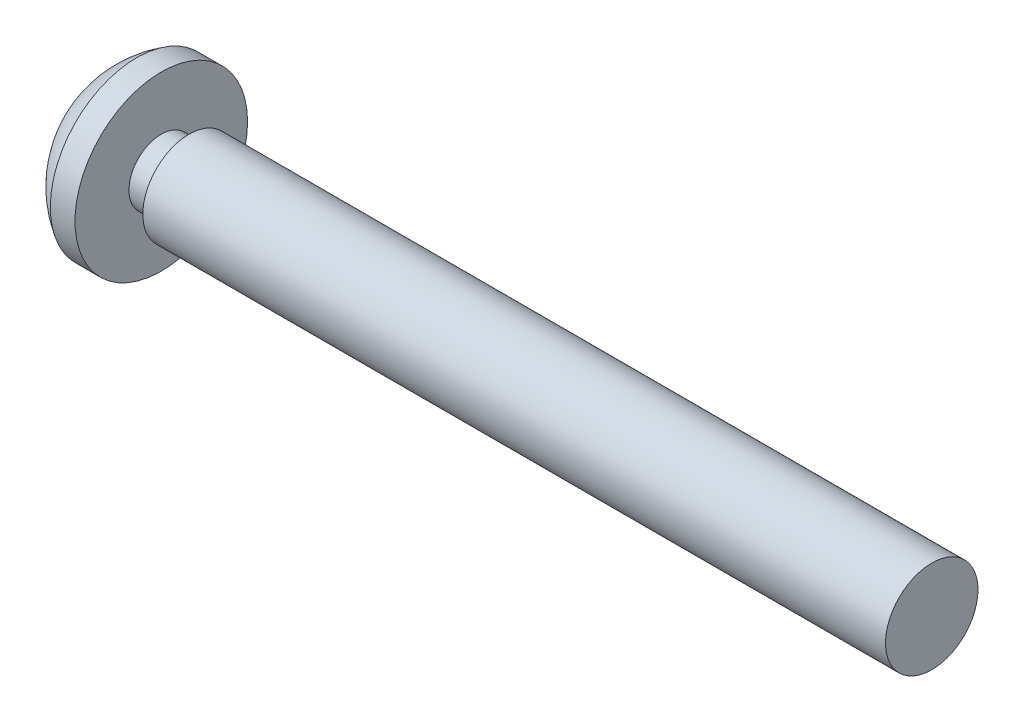
ISO-10303-21;
HEADER;
FILE_DESCRIPTION(('STEP AP214'),'2;1');
FILE_NAME('part.step','',(''),(''),'','','');
FILE_SCHEMA(('AUTOMOTIVE_DESIGN { 1 0 10303 214 1 1 1 1 }'));
ENDSEC;
DATA;
#1=APPLICATION_CONTEXT('core data for automotive mechanical design processes');
#2=APPLICATION_PROTOCOL_DEFINITION('international standard','automotive_design',2000,#1);
#3=PRODUCT_CONTEXT('',#1,'mechanical');
#4=PRODUCT('Part','Part','',(#3));
#5=PRODUCT_RELATED_PRODUCT_CATEGORY('part','',(#4));
#6=PRODUCT_DEFINITION_FORMATION('','',#4);
#7=PRODUCT_DEFINITION_CONTEXT('part definition',#1,'design');
#8=PRODUCT_DEFINITION('design','',#6,#7);
#9=PRODUCT_DEFINITION_SHAPE('','',#8);
#10=(LENGTH_UNIT() NAMED_UNIT(*) SI_UNIT(.MILLI.,.METRE.));
#11=(NAMED_UNIT(*) PLANE_ANGLE_UNIT() SI_UNIT($,.RADIAN.));
#12=(NAMED_UNIT(*) SI_UNIT($,.STERADIAN.) SOLID_ANGLE_UNIT());
#13=UNCERTAINTY_MEASURE_WITH_UNIT(LENGTH_MEASURE(1.E-05),#10,'distance_accuracy_value','');
#14=(GEOMETRIC_REPRESENTATION_CONTEXT(3) GLOBAL_UNCERTAINTY_ASSIGNED_CONTEXT((#13)) GLOBAL_UNIT_ASSIGNED_CONTEXT((#10,
#11,#12)) REPRESENTATION_CONTEXT('',''));
#15=CARTESIAN_POINT('',(0.,0.,0.));
#16=DIRECTION('',(0.,0.,1.));
#17=DIRECTION('',(1.,0.,0.));
#18=AXIS2_PLACEMENT_3D('',#15,#16,#17);
#19=CARTESIAN_POINT('',(-24.15,0.,0.));
#20=DIRECTION('',(1.,0.,0.));
#21=DIRECTION('',(0.,1.,0.));
#22=AXIS2_PLACEMENT_3D('',#19,#20,#21);
#23=SPHERICAL_SURFACE('',#22,3.25);
#24=CARTESIAN_POINT('',(-25.8,0.,0.));
#25=DIRECTION('',(1.,0.,0.));
#26=DIRECTION('',(0.,0.,-1.));
#27=AXIS2_PLACEMENT_3D('',#24,#25,#26);
#28=CIRCLE('',#27,2.8);
#29=CARTESIAN_POINT('',(-25.8,0.,-2.8));
#30=VERTEX_POINT('',#29);
#31=EDGE_CURVE('E170',#30,#30,#28,.T.);
#32=ORIENTED_EDGE('',*,*,#31,.F.);
#33=EDGE_LOOP('',(#32));
#34=FACE_BOUND('',#33,.T.);
#35=CARTESIAN_POINT('',(-27.3068940289468,0.375000066666674,-0.675199999999999));
#36=CARTESIAN_POINT('',(-27.31039538603,0.374974039787709,-0.658850385121531));
#37=CARTESIAN_POINT('',(-27.3136133722107,0.37631432389268,-0.642432860727959));
#38=CARTESIAN_POINT('',(-27.3193993644706,0.381684853078188,-0.609919694568041));
#39=CARTESIAN_POINT('',(-27.3219670797919,0.385716298547903,-0.593824199743856));
#40=CARTESIAN_POINT('',(-27.3263691557337,0.396434080962598,-0.562405806208291));
#41=CARTESIAN_POINT('',(-27.3282024640236,0.40312420038652,-0.547084043435579));
#42=CARTESIAN_POINT('',(-27.3310682853566,0.418991926287625,-0.517716698727841));
#43=CARTESIAN_POINT('',(-27.3321013161393,0.428167919333055,-0.503670296900031));
#44=CARTESIAN_POINT('',(-27.333317814792,0.448514526561983,-0.477587734148935));
#45=CARTESIAN_POINT('',(-27.3335204359993,0.45963392816965,-0.465512496825722));
#46=CARTESIAN_POINT('',(-27.3331219469987,0.483685195957618,-0.443340514979258));
#47=CARTESIAN_POINT('',(-27.3325207910735,0.496617165195829,-0.43324388303273));
#48=CARTESIAN_POINT('',(-27.3305465495203,0.52375198188587,-0.415414384530054));
#49=CARTESIAN_POINT('',(-27.3291823028179,0.53793873877994,-0.407655989689833));
#50=CARTESIAN_POINT('',(-27.3257316366459,0.567301133586124,-0.39453703708237));
#51=CARTESIAN_POINT('',(-27.3236451638736,0.582476844419147,-0.389176656363358));
#52=CARTESIAN_POINT('',(-27.3192512828636,0.610594589490666,-0.381701859125301));
#53=CARTESIAN_POINT('',(-27.317051373952,0.623446563005218,-0.379176670553307));
#54=CARTESIAN_POINT('',(-27.3122574783827,0.649278469056087,-0.375820322941036));
#55=CARTESIAN_POINT('',(-27.3096640610531,0.662258191795707,-0.37498674113212));
#56=CARTESIAN_POINT('',(-27.3068940289468,0.675199999999999,-0.375000066666674));
#57=B_SPLINE_CURVE_WITH_KNOTS('',3,(#35,#36,#37,#38,#39,#40,#41,#42,#43,#44,#45,#46,#47,#48,#49,
#50,#51,#52,#53,#54,#55,#56),.UNSPECIFIED.,.F.,.F.,(4,2,2,2,2,2,2,2,2,2,4),(0.,
0.0501133292441577,0.100249026425948,0.150456308180251,0.20063108114174,0.249641830902457,
0.298655368418994,0.347112597227158,0.395573403099857,0.435304823461775,0.474979299046477),.UNSPECIFIED.);
#58=CARTESIAN_POINT('',(-27.3069368064629,0.375,-0.675));
#59=VERTEX_POINT('',#58);
#60=CARTESIAN_POINT('',(-27.3069368064629,0.675,-0.375));
#61=VERTEX_POINT('',#60);
#62=EDGE_CURVE('E202',#59,#61,#57,.T.);
#63=ORIENTED_EDGE('',*,*,#62,.T.);
#64=CARTESIAN_POINT('',(-24.15,0.,-0.375));
#65=DIRECTION('',(0.,0.,1.));
#66=DIRECTION('',(1.,0.,0.));
#67=AXIS2_PLACEMENT_3D('',#64,#65,#66);
#68=CIRCLE('',#67,3.22829289253624);
#69=CARTESIAN_POINT('',(-26.8299020504489,1.8,-0.375));
#70=VERTEX_POINT('',#69);
#71=EDGE_CURVE('E11',#61,#70,#68,.F.);
#72=ORIENTED_EDGE('',*,*,#71,.T.);
#73=CARTESIAN_POINT('',(-24.15,1.8,0.));
#74=DIRECTION('',(0.,-1.,0.));
#75=DIRECTION('',(0.,0.,-1.));
#76=AXIS2_PLACEMENT_3D('',#73,#74,#75);
#77=CIRCLE('',#76,2.70601182554696);
#78=CARTESIAN_POINT('',(-26.8299020504489,1.8,0.375));
#79=VERTEX_POINT('',#78);
#80=EDGE_CURVE('E47',#70,#79,#77,.F.);
#81=ORIENTED_EDGE('',*,*,#80,.T.);
#82=CARTESIAN_POINT('',(-24.15,0.,0.375));
#83=DIRECTION('',(0.,0.,-1.));
#84=DIRECTION('',(0.,1.,0.));
#85=AXIS2_PLACEMENT_3D('',#82,#83,#84);
#86=CIRCLE('',#85,3.22829289253624);
#87=CARTESIAN_POINT('',(-27.3069368064629,0.675,0.375));
#88=VERTEX_POINT('',#87);
#89=EDGE_CURVE('E311',#79,#88,#86,.F.);
#90=ORIENTED_EDGE('',*,*,#89,.T.);
#91=CARTESIAN_POINT('',(-27.3068940289468,0.675199999999999,0.375000066666674));
#92=CARTESIAN_POINT('',(-27.31039538603,0.658850385121531,0.374974039787708));
#93=CARTESIAN_POINT('',(-27.3136133722107,0.642432860727959,0.37631432389268));
#94=CARTESIAN_POINT('',(-27.3193993644706,0.609919694568041,0.381684853078188));
#95=CARTESIAN_POINT('',(-27.3219670797919,0.593824199743856,0.385716298547903));
#96=CARTESIAN_POINT('',(-27.3263691557337,0.562405806208291,0.396434080962598));
#97=CARTESIAN_POINT('',(-27.3282024640236,0.547084043435579,0.403124200386519));
#98=CARTESIAN_POINT('',(-27.3310682853566,0.517716698727841,0.418991926287625));
#99=CARTESIAN_POINT('',(-27.3321013161393,0.503670296900031,0.428167919333055));
#100=CARTESIAN_POINT('',(-27.333317814792,0.477587734148935,0.448514526561983));
#101=CARTESIAN_POINT('',(-27.3335204359993,0.465512496825722,0.45963392816965));
#102=CARTESIAN_POINT('',(-27.3331219469987,0.443340514979258,0.483685195957618));
#103=CARTESIAN_POINT('',(-27.3325207910735,0.43324388303273,0.496617165195828));
#104=CARTESIAN_POINT('',(-27.3305465495203,0.415414384530054,0.52375198188587));
#105=CARTESIAN_POINT('',(-27.3291823028179,0.407655989689833,0.537938738779939));
#106=CARTESIAN_POINT('',(-27.3257316366459,0.39453703708237,0.567301133586124));
#107=CARTESIAN_POINT('',(-27.3236451638736,0.389176656363358,0.582476844419147));
#108=CARTESIAN_POINT('',(-27.3192512828636,0.381701859125301,0.610594589490666));
#109=CARTESIAN_POINT('',(-27.317051373952,0.379176670553307,0.623446563005217));
#110=CARTESIAN_POINT('',(-27.3122574783827,0.375820322941036,0.649278469056086));
#111=CARTESIAN_POINT('',(-27.3096640610531,0.37498674113212,0.662258191795707));
#112=CARTESIAN_POINT('',(-27.3068940289468,0.375000066666674,0.675199999999999));
#113=B_SPLINE_CURVE_WITH_KNOTS('',3,(#91,#92,#93,#94,#95,#96,#97,#98,#99,#100,#101,#102,#103,
#104,#105,#106,#107,#108,#109,#110,#111,#112),.UNSPECIFIED.,.F.,.F.,(4,2,2,2,2,2,2,2,2,2,4),(0.,
0.0501133292441578,0.100249026425948,0.150456308180252,0.20063108114174,0.249641830902456,
0.298655368418993,0.347112597227157,0.395573403099857,0.435304823461775,0.474979299046478),.UNSPECIFIED.);
#114=CARTESIAN_POINT('',(-27.3069368064629,0.375,0.675));
#115=VERTEX_POINT('',#114);
#116=EDGE_CURVE('E302',#88,#115,#113,.T.);
#117=ORIENTED_EDGE('',*,*,#116,.T.);
#118=CARTESIAN_POINT('',(-24.15,0.375,0.));
#119=DIRECTION('',(0.,-1.,0.));
#120=DIRECTION('',(0.,0.,-1.));
#121=AXIS2_PLACEMENT_3D('',#118,#119,#120);
#122=CIRCLE('',#121,3.22829289253624);
#123=CARTESIAN_POINT('',(-26.8299020504489,0.375,1.8));
#124=VERTEX_POINT('',#123);
#125=EDGE_CURVE('E312',#115,#124,#122,.F.);
#126=ORIENTED_EDGE('',*,*,#125,.T.);
#127=CARTESIAN_POINT('',(-24.15,0.,1.8));
#128=DIRECTION('',(0.,0.,-1.));
#129=DIRECTION('',(-1.,0.,0.));
#130=AXIS2_PLACEMENT_3D('',#127,#128,#129);
#131=CIRCLE('',#130,2.70601182554696);
#132=CARTESIAN_POINT('',(-26.8299020504489,-0.375,1.8));
#133=VERTEX_POINT('',#132);
#134=EDGE_CURVE('E431',#124,#133,#131,.F.);
#135=ORIENTED_EDGE('',*,*,#134,.T.);
#136=CARTESIAN_POINT('',(-24.15,-0.375,0.));
#137=DIRECTION('',(0.,1.,0.));
#138=DIRECTION('',(0.,0.,1.));
#139=AXIS2_PLACEMENT_3D('',#136,#137,#138);
#140=CIRCLE('',#139,3.22829289253624);
#141=CARTESIAN_POINT('',(-27.3069368064629,-0.375,0.675));
#142=VERTEX_POINT('',#141);
#143=EDGE_CURVE('E273',#133,#142,#140,.F.);
#144=ORIENTED_EDGE('',*,*,#143,.T.);
#145=CARTESIAN_POINT('',(-27.3068940289468,-0.375000066666674,0.675199999999999));
#146=CARTESIAN_POINT('',(-27.31039538603,-0.374974039787708,0.658850385121531));
#147=CARTESIAN_POINT('',(-27.3136133722107,-0.37631432389268,0.642432860727959));
#148=CARTESIAN_POINT('',(-27.3193993644706,-0.381684853078188,0.609919694568042));
#149=CARTESIAN_POINT('',(-27.3219670797919,-0.385716298547903,0.593824199743856));
#150=CARTESIAN_POINT('',(-27.3263691557337,-0.396434080962598,0.562405806208292));
#151=CARTESIAN_POINT('',(-27.3282024640236,-0.403124200386519,0.547084043435579));
#152=CARTESIAN_POINT('',(-27.3310682853566,-0.418991926287625,0.517716698727842));
#153=CARTESIAN_POINT('',(-27.3321013161393,-0.428167919333055,0.503670296900031));
#154=CARTESIAN_POINT('',(-27.333317814792,-0.448514526561982,0.477587734148936));
#155=CARTESIAN_POINT('',(-27.3335204359993,-0.45963392816965,0.465512496825722));
#156=CARTESIAN_POINT('',(-27.3331219469987,-0.483685195957617,0.443340514979258));
#157=CARTESIAN_POINT('',(-27.3325207910735,-0.496617165195828,0.433243883032731));
#158=CARTESIAN_POINT('',(-27.3305465495203,-0.523751981885869,0.415414384530054));
#159=CARTESIAN_POINT('',(-27.3291823028179,-0.537938738779939,0.407655989689833));
#160=CARTESIAN_POINT('',(-27.3257316366459,-0.567301133586124,0.39453703708237));
#161=CARTESIAN_POINT('',(-27.3236451638736,-0.582476844419147,0.389176656363358));
#162=CARTESIAN_POINT('',(-27.3192512828636,-0.610594589490666,0.381701859125301));
#163=CARTESIAN_POINT('',(-27.317051373952,-0.623446563005218,0.379176670553306));
#164=CARTESIAN_POINT('',(-27.3122574783827,-0.649278469056087,0.375820322941036));
#165=CARTESIAN_POINT('',(-27.3096640610531,-0.662258191795707,0.37498674113212));
#166=CARTESIAN_POINT('',(-27.3068940289468,-0.675199999999999,0.375000066666674));
#167=B_SPLINE_CURVE_WITH_KNOTS('',3,(#145,#146,#147,#148,#149,#150,#151,#152,#153,#154,#155,
#156,#157,#158,#159,#160,#161,#162,#163,#164,#165,#166),.UNSPECIFIED.,.F.,.F.,(4,2,2,2,2,2,2,2,
2,2,4),(0.,0.0501133292441573,0.100249026425948,0.150456308180251,0.200631081141739,
0.249641830902456,0.298655368418994,0.347112597227157,0.395573403099857,0.435304823461776,
0.474979299046479),.UNSPECIFIED.);
#168=CARTESIAN_POINT('',(-27.3069368064629,-0.675,0.375));
#169=VERTEX_POINT('',#168);
#170=EDGE_CURVE('E264',#142,#169,#167,.T.);
#171=ORIENTED_EDGE('',*,*,#170,.T.);
#172=CARTESIAN_POINT('',(-24.15,0.,0.375));
#173=DIRECTION('',(0.,0.,-1.));
#174=DIRECTION('',(-1.,0.,0.));
#175=AXIS2_PLACEMENT_3D('',#172,#173,#174);
#176=CIRCLE('',#175,3.22829289253624);
#177=CARTESIAN_POINT('',(-26.8299020504489,-1.8,0.375));
#178=VERTEX_POINT('',#177);
#179=EDGE_CURVE('E260',#169,#178,#176,.F.);
#180=ORIENTED_EDGE('',*,*,#179,.T.);
#181=CARTESIAN_POINT('',(-24.15,-1.8,0.));
#182=DIRECTION('',(0.,1.,0.));
#183=DIRECTION('',(0.,0.,1.));
#184=AXIS2_PLACEMENT_3D('',#181,#182,#183);
#185=CIRCLE('',#184,2.70601182554696);
#186=CARTESIAN_POINT('',(-26.8299020504489,-1.8,-0.375));
#187=VERTEX_POINT('',#186);
#188=EDGE_CURVE('E256',#178,#187,#185,.F.);
#189=ORIENTED_EDGE('',*,*,#188,.T.);
#190=CARTESIAN_POINT('',(-24.15,0.,-0.375));
#191=DIRECTION('',(0.,0.,1.));
#192=DIRECTION('',(0.,-1.,0.));
#193=AXIS2_PLACEMENT_3D('',#190,#191,#192);
#194=CIRCLE('',#193,3.22829289253624);
#195=CARTESIAN_POINT('',(-27.3069368064629,-0.675,-0.375));
#196=VERTEX_POINT('',#195);
#197=EDGE_CURVE('E251',#187,#196,#194,.F.);
#198=ORIENTED_EDGE('',*,*,#197,.T.);
#199=CARTESIAN_POINT('',(-27.3068940289468,-0.675199999999999,-0.375000066666674));
#200=CARTESIAN_POINT('',(-27.31039538603,-0.658850385121531,-0.374974039787709));
#201=CARTESIAN_POINT('',(-27.3136133722107,-0.642432860727959,-0.37631432389268));
#202=CARTESIAN_POINT('',(-27.3193993644706,-0.609919694568042,-0.381684853078188));
#203=CARTESIAN_POINT('',(-27.3219670797919,-0.593824199743856,-0.385716298547903));
#204=CARTESIAN_POINT('',(-27.3263691557337,-0.562405806208292,-0.396434080962598));
#205=CARTESIAN_POINT('',(-27.3282024640236,-0.547084043435579,-0.403124200386519));
#206=CARTESIAN_POINT('',(-27.3310682853566,-0.517716698727842,-0.418991926287625));
#207=CARTESIAN_POINT('',(-27.3321013161393,-0.503670296900031,-0.428167919333055));
#208=CARTESIAN_POINT('',(-27.333317814792,-0.477587734148936,-0.448514526561982));
#209=CARTESIAN_POINT('',(-27.3335204359993,-0.465512496825722,-0.45963392816965));
#210=CARTESIAN_POINT('',(-27.3331219469987,-0.443340514979258,-0.483685195957618));
#211=CARTESIAN_POINT('',(-27.3325207910735,-0.433243883032731,-0.496617165195828));
#212=CARTESIAN_POINT('',(-27.3305465495203,-0.415414384530054,-0.52375198188587));
#213=CARTESIAN_POINT('',(-27.3291823028179,-0.407655989689833,-0.537938738779939));
#214=CARTESIAN_POINT('',(-27.3257316366459,-0.39453703708237,-0.567301133586124));
#215=CARTESIAN_POINT('',(-27.3236451638736,-0.389176656363358,-0.582476844419147));
#216=CARTESIAN_POINT('',(-27.3192512828636,-0.381701859125301,-0.610594589490667));
#217=CARTESIAN_POINT('',(-27.317051373952,-0.379176670553306,-0.623446563005218));
#218=CARTESIAN_POINT('',(-27.3122574783827,-0.375820322941036,-0.649278469056087));
#219=CARTESIAN_POINT('',(-27.3096640610531,-0.37498674113212,-0.662258191795707));
#220=CARTESIAN_POINT('',(-27.3068940289468,-0.375000066666674,-0.675199999999999));
#221=B_SPLINE_CURVE_WITH_KNOTS('',3,(#199,#200,#201,#202,#203,#204,#205,#206,#207,#208,#209,
#210,#211,#212,#213,#214,#215,#216,#217,#218,#219,#220),.UNSPECIFIED.,.F.,.F.,(4,2,2,2,2,2,2,2,
2,2,4),(0.,0.0501133292441573,0.100249026425948,0.150456308180251,0.200631081141739,
0.249641830902456,0.298655368418994,0.347112597227158,0.395573403099857,0.435304823461776,
0.474979299046478),.UNSPECIFIED.);
#222=CARTESIAN_POINT('',(-27.3069368064629,-0.375,-0.675));
#223=VERTEX_POINT('',#222);
#224=EDGE_CURVE('E242',#196,#223,#221,.T.);
#225=ORIENTED_EDGE('',*,*,#224,.T.);
#226=CARTESIAN_POINT('',(-24.15,-0.375,0.));
#227=DIRECTION('',(0.,1.,0.));
#228=DIRECTION('',(0.,0.,1.));
#229=AXIS2_PLACEMENT_3D('',#226,#227,#228);
#230=CIRCLE('',#229,3.22829289253624);
#231=CARTESIAN_POINT('',(-26.8299020504489,-0.375,-1.8));
#232=VERTEX_POINT('',#231);
#233=EDGE_CURVE('E252',#223,#232,#230,.F.);
#234=ORIENTED_EDGE('',*,*,#233,.T.);
#235=CARTESIAN_POINT('',(-24.15,0.,-1.8));
#236=DIRECTION('',(0.,0.,1.));
#237=DIRECTION('',(1.,0.,0.));
#238=AXIS2_PLACEMENT_3D('',#235,#236,#237);
#239=CIRCLE('',#238,2.70601182554696);
#240=CARTESIAN_POINT('',(-26.8299020504489,0.375,-1.8));
#241=VERTEX_POINT('',#240);
#242=EDGE_CURVE('E424',#232,#241,#239,.F.);
#243=ORIENTED_EDGE('',*,*,#242,.T.);
#244=CARTESIAN_POINT('',(-24.15,0.375,0.));
#245=DIRECTION('',(0.,-1.,0.));
#246=DIRECTION('',(0.,0.,-1.));
#247=AXIS2_PLACEMENT_3D('',#244,#245,#246);
#248=CIRCLE('',#247,3.22829289253624);
#249=EDGE_CURVE('E212',#241,#59,#248,.F.);
#250=ORIENTED_EDGE('',*,*,#249,.T.);
#251=EDGE_LOOP('',(#63,#72,#81,#90,#117,#126,#135,#144,#171,#180,#189,#198,#225,#234,#243,#250));
#252=FACE_BOUND('',#251,.T.);
#253=ADVANCED_FACE('F38',(#34,#252),#23,.T.);
#254=CARTESIAN_POINT('',(0.,0.,0.));
#255=DIRECTION('',(1.,0.,0.));
#256=DIRECTION('',(0.,0.,-1.));
#257=AXIS2_PLACEMENT_3D('',#254,#255,#256);
#258=PLANE('',#257);
#259=CARTESIAN_POINT('',(0.,0.,0.));
#260=DIRECTION('',(1.,0.,0.));
#261=DIRECTION('',(0.,0.,-1.));
#262=AXIS2_PLACEMENT_3D('',#259,#260,#261);
#263=CIRCLE('',#262,1.5);
#264=CARTESIAN_POINT('',(0.,0.,-1.5));
#265=VERTEX_POINT('',#264);
#266=EDGE_CURVE('E198',#265,#265,#263,.T.);
#267=ORIENTED_EDGE('',*,*,#266,.T.);
#268=EDGE_LOOP('',(#267));
#269=FACE_BOUND('',#268,.T.);
#270=ADVANCED_FACE('F40',(#269),#258,.T.);
#271=CARTESIAN_POINT('',(0.,0.,0.));
#272=DIRECTION('',(1.,0.,0.));
#273=DIRECTION('',(0.,0.,-1.));
#274=AXIS2_PLACEMENT_3D('',#271,#272,#273);
#275=CYLINDRICAL_SURFACE('',#274,1.5);
#276=CARTESIAN_POINT('',(-24.1,0.,0.));
#277=DIRECTION('',(1.,0.,0.));
#278=DIRECTION('',(0.,0.,-1.));
#279=AXIS2_PLACEMENT_3D('',#276,#277,#278);
#280=CIRCLE('',#279,1.5);
#281=CARTESIAN_POINT('',(-24.1,0.,-1.5));
#282=VERTEX_POINT('',#281);
#283=EDGE_CURVE('E194',#282,#282,#280,.T.);
#284=ORIENTED_EDGE('',*,*,#283,.T.);
#285=EDGE_LOOP('',(#284));
#286=FACE_BOUND('',#285,.T.);
#287=ORIENTED_EDGE('',*,*,#266,.F.);
#288=EDGE_LOOP('',(#287));
#289=FACE_BOUND('',#288,.T.);
#290=ADVANCED_FACE('F461',(#286,#289),#275,.T.);
#291=CARTESIAN_POINT('',(-24.1,1.5,0.));
#292=DIRECTION('',(-1.,0.,0.));
#293=DIRECTION('',(0.,0.,1.));
#294=AXIS2_PLACEMENT_3D('',#291,#292,#293);
#295=PLANE('',#294);
#296=CARTESIAN_POINT('',(-24.1,0.,0.));
#297=DIRECTION('',(1.,0.,0.));
#298=DIRECTION('',(0.,0.,-1.));
#299=AXIS2_PLACEMENT_3D('',#296,#297,#298);
#300=CIRCLE('',#299,1.05);
#301=CARTESIAN_POINT('',(-24.1,0.,-1.05));
#302=VERTEX_POINT('',#301);
#303=EDGE_CURVE('E191',#302,#302,#300,.T.);
#304=ORIENTED_EDGE('',*,*,#303,.T.);
#305=EDGE_LOOP('',(#304));
#306=FACE_BOUND('',#305,.T.);
#307=ORIENTED_EDGE('',*,*,#283,.F.);
#308=EDGE_LOOP('',(#307));
#309=FACE_BOUND('',#308,.T.);
#310=ADVANCED_FACE('F479',(#306,#309),#295,.T.);
#311=CARTESIAN_POINT('',(0.,0.,0.));
#312=DIRECTION('',(1.,0.,0.));
#313=DIRECTION('',(0.,0.,-1.));
#314=AXIS2_PLACEMENT_3D('',#311,#312,#313);
#315=CYLINDRICAL_SURFACE('',#314,1.05);
#316=CARTESIAN_POINT('',(-25.,0.,0.));
#317=DIRECTION('',(1.,0.,0.));
#318=DIRECTION('',(0.,0.,-1.));
#319=AXIS2_PLACEMENT_3D('',#316,#317,#318);
#320=CIRCLE('',#319,1.05);
#321=CARTESIAN_POINT('',(-25.,0.,-1.05));
#322=VERTEX_POINT('',#321);
#323=EDGE_CURVE('E187',#322,#322,#320,.T.);
#324=ORIENTED_EDGE('',*,*,#323,.T.);
#325=EDGE_LOOP('',(#324));
#326=FACE_BOUND('',#325,.T.);
#327=ORIENTED_EDGE('',*,*,#303,.F.);
#328=EDGE_LOOP('',(#327));
#329=FACE_BOUND('',#328,.T.);
#330=ADVANCED_FACE('F473',(#326,#329),#315,.T.);
#331=CARTESIAN_POINT('',(-25.,1.05,0.));
#332=DIRECTION('',(1.,0.,0.));
#333=DIRECTION('',(0.,0.,-1.));
#334=AXIS2_PLACEMENT_3D('',#331,#332,#333);
#335=PLANE('',#334);
#336=CARTESIAN_POINT('',(-25.,0.,0.));
#337=DIRECTION('',(1.,0.,0.));
#338=DIRECTION('',(0.,0.,-1.));
#339=AXIS2_PLACEMENT_3D('',#336,#337,#338);
#340=CIRCLE('',#339,2.8);
#341=CARTESIAN_POINT('',(-25.,0.,-2.8));
#342=VERTEX_POINT('',#341);
#343=EDGE_CURVE('E177',#342,#342,#340,.T.);
#344=ORIENTED_EDGE('',*,*,#343,.T.);
#345=EDGE_LOOP('',(#344));
#346=FACE_BOUND('',#345,.T.);
#347=ORIENTED_EDGE('',*,*,#323,.F.);
#348=EDGE_LOOP('',(#347));
#349=FACE_BOUND('',#348,.T.);
#350=ADVANCED_FACE('F468',(#346,#349),#335,.T.);
#351=CARTESIAN_POINT('',(0.,0.,0.));
#352=DIRECTION('',(1.,0.,0.));
#353=DIRECTION('',(0.,0.,-1.));
#354=AXIS2_PLACEMENT_3D('',#351,#352,#353);
#355=CYLINDRICAL_SURFACE('',#354,2.8);
#356=ORIENTED_EDGE('',*,*,#31,.T.);
#357=EDGE_LOOP('',(#356));
#358=FACE_BOUND('',#357,.T.);
#359=ORIENTED_EDGE('',*,*,#343,.F.);
#360=EDGE_LOOP('',(#359));
#361=FACE_BOUND('',#360,.T.);
#362=ADVANCED_FACE('F465',(#358,#361),#355,.T.);
#363=CARTESIAN_POINT('',(-26.2,1.8,-0.375));
#364=DIRECTION('',(0.,0.,1.));
#365=DIRECTION('',(1.,0.,0.));
#366=AXIS2_PLACEMENT_3D('',#363,#364,#365);
#367=PLANE('',#366);
#368=DIRECTION('',(-1.,0.,0.));
#369=VECTOR('',#368,1.);
#370=CARTESIAN_POINT('',(-26.2,0.675,-0.375));
#371=LINE('',#370,#369);
#372=CARTESIAN_POINT('',(-26.2,0.675,-0.375));
#373=VERTEX_POINT('',#372);
#374=EDGE_CURVE('E54',#373,#61,#371,.T.);
#375=ORIENTED_EDGE('',*,*,#374,.F.);
#376=DIRECTION('',(0.,1.,0.));
#377=VECTOR('',#376,1.);
#378=CARTESIAN_POINT('',(-26.2,1.8,-0.375));
#379=LINE('',#378,#377);
#380=CARTESIAN_POINT('',(-26.2,1.8,-0.375));
#381=VERTEX_POINT('',#380);
#382=EDGE_CURVE('E157',#373,#381,#379,.T.);
#383=ORIENTED_EDGE('',*,*,#382,.T.);
#384=DIRECTION('',(-1.,0.,0.));
#385=VECTOR('',#384,1.);
#386=CARTESIAN_POINT('',(-26.2,1.8,-0.375));
#387=LINE('',#386,#385);
#388=EDGE_CURVE('E165',#381,#70,#387,.T.);
#389=ORIENTED_EDGE('',*,*,#388,.T.);
#390=ORIENTED_EDGE('',*,*,#71,.F.);
#391=EDGE_LOOP('',(#375,#383,#389,#390));
#392=FACE_BOUND('',#391,.T.);
#393=ADVANCED_FACE('F164',(#392),#367,.T.);
#394=CARTESIAN_POINT('',(-26.2,1.8,-0.375));
#395=DIRECTION('',(0.,-1.,0.));
#396=DIRECTION('',(0.,0.,-1.));
#397=AXIS2_PLACEMENT_3D('',#394,#395,#396);
#398=PLANE('',#397);
#399=ORIENTED_EDGE('',*,*,#388,.F.);
#400=DIRECTION('',(0.,0.,1.));
#401=VECTOR('',#400,1.);
#402=CARTESIAN_POINT('',(-26.2,1.8,-0.375));
#403=LINE('',#402,#401);
#404=CARTESIAN_POINT('',(-26.2,1.8,0.375));
#405=VERTEX_POINT('',#404);
#406=EDGE_CURVE('E153',#381,#405,#403,.T.);
#407=ORIENTED_EDGE('',*,*,#406,.T.);
#408=DIRECTION('',(-1.,0.,0.));
#409=VECTOR('',#408,1.);
#410=CARTESIAN_POINT('',(-26.2,1.8,0.375));
#411=LINE('',#410,#409);
#412=EDGE_CURVE('E171',#405,#79,#411,.T.);
#413=ORIENTED_EDGE('',*,*,#412,.T.);
#414=ORIENTED_EDGE('',*,*,#80,.F.);
#415=EDGE_LOOP('',(#399,#407,#413,#414));
#416=FACE_BOUND('',#415,.T.);
#417=ADVANCED_FACE('F168',(#416),#398,.T.);
#418=CARTESIAN_POINT('',(-26.2,1.8,0.375));
#419=DIRECTION('',(0.,0.,-1.));
#420=DIRECTION('',(0.,1.,0.));
#421=AXIS2_PLACEMENT_3D('',#418,#419,#420);
#422=PLANE('',#421);
#423=ORIENTED_EDGE('',*,*,#412,.F.);
#424=DIRECTION('',(0.,-1.,0.));
#425=VECTOR('',#424,1.);
#426=CARTESIAN_POINT('',(-26.2,1.8,0.375));
#427=LINE('',#426,#425);
#428=CARTESIAN_POINT('',(-26.2,0.675,0.375));
#429=VERTEX_POINT('',#428);
#430=EDGE_CURVE('E159',#405,#429,#427,.T.);
#431=ORIENTED_EDGE('',*,*,#430,.T.);
#432=DIRECTION('',(-1.,0.,0.));
#433=VECTOR('',#432,1.);
#434=CARTESIAN_POINT('',(-26.2,0.675,0.375));
#435=LINE('',#434,#433);
#436=EDGE_CURVE('E180',#429,#88,#435,.T.);
#437=ORIENTED_EDGE('',*,*,#436,.T.);
#438=ORIENTED_EDGE('',*,*,#89,.F.);
#439=EDGE_LOOP('',(#423,#431,#437,#438));
#440=FACE_BOUND('',#439,.T.);
#441=ADVANCED_FACE('F298',(#440),#422,.T.);
#442=CARTESIAN_POINT('',(-26.2,0.675,0.675));
#443=DIRECTION('',(-1.,0.,0.));
#444=DIRECTION('',(0.,0.,1.));
#445=AXIS2_PLACEMENT_3D('',#442,#443,#444);
#446=CYLINDRICAL_SURFACE('',#445,0.3);
#447=ORIENTED_EDGE('',*,*,#436,.F.);
#448=CARTESIAN_POINT('',(-26.2,0.675,0.675));
#449=DIRECTION('',(-1.,0.,0.));
#450=DIRECTION('',(0.,0.,1.));
#451=AXIS2_PLACEMENT_3D('',#448,#449,#450);
#452=CIRCLE('',#451,0.3);
#453=CARTESIAN_POINT('',(-26.2,0.375,0.675));
#454=VERTEX_POINT('',#453);
#455=EDGE_CURVE('E378',#429,#454,#452,.T.);
#456=ORIENTED_EDGE('',*,*,#455,.T.);
#457=DIRECTION('',(-1.,0.,0.));
#458=VECTOR('',#457,1.);
#459=CARTESIAN_POINT('',(-26.2,0.375,0.675));
#460=LINE('',#459,#458);
#461=EDGE_CURVE('E371',#454,#115,#460,.T.);
#462=ORIENTED_EDGE('',*,*,#461,.T.);
#463=ORIENTED_EDGE('',*,*,#116,.F.);
#464=EDGE_LOOP('',(#447,#456,#462,#463));
#465=FACE_BOUND('',#464,.T.);
#466=ADVANCED_FACE('F293',(#465),#446,.T.);
#467=CARTESIAN_POINT('',(-26.2,0.375,0.675));
#468=DIRECTION('',(0.,-1.,0.));
#469=DIRECTION('',(0.,0.,-1.));
#470=AXIS2_PLACEMENT_3D('',#467,#468,#469);
#471=PLANE('',#470);
#472=ORIENTED_EDGE('',*,*,#461,.F.);
#473=DIRECTION('',(0.,0.,1.));
#474=VECTOR('',#473,1.);
#475=CARTESIAN_POINT('',(-26.2,0.375,0.675));
#476=LINE('',#475,#474);
#477=CARTESIAN_POINT('',(-26.2,0.375,1.8));
#478=VERTEX_POINT('',#477);
#479=EDGE_CURVE('E382',#454,#478,#476,.T.);
#480=ORIENTED_EDGE('',*,*,#479,.T.);
#481=DIRECTION('',(-1.,0.,0.));
#482=VECTOR('',#481,1.);
#483=CARTESIAN_POINT('',(-26.2,0.375,1.8));
#484=LINE('',#483,#482);
#485=EDGE_CURVE('E368',#478,#124,#484,.T.);
#486=ORIENTED_EDGE('',*,*,#485,.T.);
#487=ORIENTED_EDGE('',*,*,#125,.F.);
#488=EDGE_LOOP('',(#472,#480,#486,#487));
#489=FACE_BOUND('',#488,.T.);
#490=ADVANCED_FACE('F289',(#489),#471,.T.);
#491=CARTESIAN_POINT('',(-26.2,0.375,1.8));
#492=DIRECTION('',(0.,0.,-1.));
#493=DIRECTION('',(-1.,0.,0.));
#494=AXIS2_PLACEMENT_3D('',#491,#492,#493);
#495=PLANE('',#494);
#496=ORIENTED_EDGE('',*,*,#485,.F.);
#497=DIRECTION('',(0.,-1.,0.));
#498=VECTOR('',#497,1.);
#499=CARTESIAN_POINT('',(-26.2,0.375,1.8));
#500=LINE('',#499,#498);
#501=CARTESIAN_POINT('',(-26.2,-0.375,1.8));
#502=VERTEX_POINT('',#501);
#503=EDGE_CURVE('E387',#478,#502,#500,.T.);
#504=ORIENTED_EDGE('',*,*,#503,.T.);
#505=DIRECTION('',(-1.,0.,0.));
#506=VECTOR('',#505,1.);
#507=CARTESIAN_POINT('',(-26.2,-0.375,1.8));
#508=LINE('',#507,#506);
#509=EDGE_CURVE('E364',#502,#133,#508,.T.);
#510=ORIENTED_EDGE('',*,*,#509,.T.);
#511=ORIENTED_EDGE('',*,*,#134,.F.);
#512=EDGE_LOOP('',(#496,#504,#510,#511));
#513=FACE_BOUND('',#512,.T.);
#514=ADVANCED_FACE('F285',(#513),#495,.T.);
#515=CARTESIAN_POINT('',(-26.2,-0.375,0.675));
#516=DIRECTION('',(0.,1.,0.));
#517=DIRECTION('',(0.,0.,1.));
#518=AXIS2_PLACEMENT_3D('',#515,#516,#517);
#519=PLANE('',#518);
#520=ORIENTED_EDGE('',*,*,#509,.F.);
#521=DIRECTION('',(0.,0.,-1.));
#522=VECTOR('',#521,1.);
#523=CARTESIAN_POINT('',(-26.2,-0.375,0.675));
#524=LINE('',#523,#522);
#525=CARTESIAN_POINT('',(-26.2,-0.375,0.675));
#526=VERTEX_POINT('',#525);
#527=EDGE_CURVE('E394',#502,#526,#524,.T.);
#528=ORIENTED_EDGE('',*,*,#527,.T.);
#529=DIRECTION('',(-1.,0.,0.));
#530=VECTOR('',#529,1.);
#531=CARTESIAN_POINT('',(-26.2,-0.375,0.675));
#532=LINE('',#531,#530);
#533=EDGE_CURVE('E360',#526,#142,#532,.T.);
#534=ORIENTED_EDGE('',*,*,#533,.T.);
#535=ORIENTED_EDGE('',*,*,#143,.F.);
#536=EDGE_LOOP('',(#520,#528,#534,#535));
#537=FACE_BOUND('',#536,.T.);
#538=ADVANCED_FACE('F281',(#537),#519,.T.);
#539=CARTESIAN_POINT('',(-26.2,-0.675,0.675));
#540=DIRECTION('',(-1.,0.,0.));
#541=DIRECTION('',(0.,0.,1.));
#542=AXIS2_PLACEMENT_3D('',#539,#540,#541);
#543=CYLINDRICAL_SURFACE('',#542,0.3);
#544=ORIENTED_EDGE('',*,*,#533,.F.);
#545=CARTESIAN_POINT('',(-26.2,-0.675,0.675));
#546=DIRECTION('',(-1.,0.,0.));
#547=DIRECTION('',(0.,0.,-1.));
#548=AXIS2_PLACEMENT_3D('',#545,#546,#547);
#549=CIRCLE('',#548,0.3);
#550=CARTESIAN_POINT('',(-26.2,-0.675,0.375));
#551=VERTEX_POINT('',#550);
#552=EDGE_CURVE('E397',#526,#551,#549,.T.);
#553=ORIENTED_EDGE('',*,*,#552,.T.);
#554=DIRECTION('',(-1.,0.,0.));
#555=VECTOR('',#554,1.);
#556=CARTESIAN_POINT('',(-26.2,-0.675,0.375));
#557=LINE('',#556,#555);
#558=EDGE_CURVE('E356',#551,#169,#557,.T.);
#559=ORIENTED_EDGE('',*,*,#558,.T.);
#560=ORIENTED_EDGE('',*,*,#170,.F.);
#561=EDGE_LOOP('',(#544,#553,#559,#560));
#562=FACE_BOUND('',#561,.T.);
#563=ADVANCED_FACE('F275',(#562),#543,.T.);
#564=CARTESIAN_POINT('',(-26.2,-0.675,0.375));
#565=DIRECTION('',(0.,0.,-1.));
#566=DIRECTION('',(-1.,0.,0.));
#567=AXIS2_PLACEMENT_3D('',#564,#565,#566);
#568=PLANE('',#567);
#569=ORIENTED_EDGE('',*,*,#558,.F.);
#570=DIRECTION('',(0.,-1.,0.));
#571=VECTOR('',#570,1.);
#572=CARTESIAN_POINT('',(-26.2,-0.675,0.375));
#573=LINE('',#572,#571);
#574=CARTESIAN_POINT('',(-26.2,-1.8,0.375));
#575=VERTEX_POINT('',#574);
#576=EDGE_CURVE('E400',#551,#575,#573,.T.);
#577=ORIENTED_EDGE('',*,*,#576,.T.);
#578=DIRECTION('',(-1.,0.,0.));
#579=VECTOR('',#578,1.);
#580=CARTESIAN_POINT('',(-26.2,-1.8,0.375));
#581=LINE('',#580,#579);
#582=EDGE_CURVE('E352',#575,#178,#581,.T.);
#583=ORIENTED_EDGE('',*,*,#582,.T.);
#584=ORIENTED_EDGE('',*,*,#179,.F.);
#585=EDGE_LOOP('',(#569,#577,#583,#584));
#586=FACE_BOUND('',#585,.T.);
#587=ADVANCED_FACE('F280',(#586),#568,.T.);
#588=CARTESIAN_POINT('',(-26.2,-1.8,-0.375));
#589=DIRECTION('',(0.,1.,0.));
#590=DIRECTION('',(0.,0.,1.));
#591=AXIS2_PLACEMENT_3D('',#588,#589,#590);
#592=PLANE('',#591);
#593=ORIENTED_EDGE('',*,*,#582,.F.);
#594=DIRECTION('',(0.,0.,-1.));
#595=VECTOR('',#594,1.);
#596=CARTESIAN_POINT('',(-26.2,-1.8,-0.375));
#597=LINE('',#596,#595);
#598=CARTESIAN_POINT('',(-26.2,-1.8,-0.375));
#599=VERTEX_POINT('',#598);
#600=EDGE_CURVE('E403',#575,#599,#597,.T.);
#601=ORIENTED_EDGE('',*,*,#600,.T.);
#602=DIRECTION('',(-1.,0.,0.));
#603=VECTOR('',#602,1.);
#604=CARTESIAN_POINT('',(-26.2,-1.8,-0.375));
#605=LINE('',#604,#603);
#606=EDGE_CURVE('E348',#599,#187,#605,.T.);
#607=ORIENTED_EDGE('',*,*,#606,.T.);
#608=ORIENTED_EDGE('',*,*,#188,.F.);
#609=EDGE_LOOP('',(#593,#601,#607,#608));
#610=FACE_BOUND('',#609,.T.);
#611=ADVANCED_FACE('F449',(#610),#592,.T.);
#612=CARTESIAN_POINT('',(-26.2,-0.675,-0.375));
#613=DIRECTION('',(0.,0.,1.));
#614=DIRECTION('',(0.,-1.,0.));
#615=AXIS2_PLACEMENT_3D('',#612,#613,#614);
#616=PLANE('',#615);
#617=ORIENTED_EDGE('',*,*,#606,.F.);
#618=DIRECTION('',(0.,1.,0.));
#619=VECTOR('',#618,1.);
#620=CARTESIAN_POINT('',(-26.2,-0.675,-0.375));
#621=LINE('',#620,#619);
#622=CARTESIAN_POINT('',(-26.2,-0.675,-0.375));
#623=VERTEX_POINT('',#622);
#624=EDGE_CURVE('E406',#599,#623,#621,.T.);
#625=ORIENTED_EDGE('',*,*,#624,.T.);
#626=DIRECTION('',(-1.,0.,0.));
#627=VECTOR('',#626,1.);
#628=CARTESIAN_POINT('',(-26.2,-0.675,-0.375));
#629=LINE('',#628,#627);
#630=EDGE_CURVE('E345',#623,#196,#629,.T.);
#631=ORIENTED_EDGE('',*,*,#630,.T.);
#632=ORIENTED_EDGE('',*,*,#197,.F.);
#633=EDGE_LOOP('',(#617,#625,#631,#632));
#634=FACE_BOUND('',#633,.T.);
#635=ADVANCED_FACE('F238',(#634),#616,.T.);
#636=CARTESIAN_POINT('',(-26.2,-0.675,-0.675));
#637=DIRECTION('',(-1.,0.,0.));
#638=DIRECTION('',(0.,0.,1.));
#639=AXIS2_PLACEMENT_3D('',#636,#637,#638);
#640=CYLINDRICAL_SURFACE('',#639,0.3);
#641=ORIENTED_EDGE('',*,*,#630,.F.);
#642=CARTESIAN_POINT('',(-26.2,-0.675,-0.675));
#643=DIRECTION('',(-1.,0.,0.));
#644=DIRECTION('',(0.,0.,1.));
#645=AXIS2_PLACEMENT_3D('',#642,#643,#644);
#646=CIRCLE('',#645,0.3);
#647=CARTESIAN_POINT('',(-26.2,-0.375,-0.675));
#648=VERTEX_POINT('',#647);
#649=EDGE_CURVE('E409',#623,#648,#646,.T.);
#650=ORIENTED_EDGE('',*,*,#649,.T.);
#651=DIRECTION('',(-1.,0.,0.));
#652=VECTOR('',#651,1.);
#653=CARTESIAN_POINT('',(-26.2,-0.375,-0.675));
#654=LINE('',#653,#652);
#655=EDGE_CURVE('E341',#648,#223,#654,.T.);
#656=ORIENTED_EDGE('',*,*,#655,.T.);
#657=ORIENTED_EDGE('',*,*,#224,.F.);
#658=EDGE_LOOP('',(#641,#650,#656,#657));
#659=FACE_BOUND('',#658,.T.);
#660=ADVANCED_FACE('F233',(#659),#640,.T.);
#661=CARTESIAN_POINT('',(-26.2,-0.375,-1.8));
#662=DIRECTION('',(0.,1.,0.));
#663=DIRECTION('',(0.,0.,1.));
#664=AXIS2_PLACEMENT_3D('',#661,#662,#663);
#665=PLANE('',#664);
#666=ORIENTED_EDGE('',*,*,#655,.F.);
#667=DIRECTION('',(0.,0.,-1.));
#668=VECTOR('',#667,1.);
#669=CARTESIAN_POINT('',(-26.2,-0.375,-1.8));
#670=LINE('',#669,#668);
#671=CARTESIAN_POINT('',(-26.2,-0.375,-1.8));
#672=VERTEX_POINT('',#671);
#673=EDGE_CURVE('E412',#648,#672,#670,.T.);
#674=ORIENTED_EDGE('',*,*,#673,.T.);
#675=DIRECTION('',(-1.,0.,0.));
#676=VECTOR('',#675,1.);
#677=CARTESIAN_POINT('',(-26.2,-0.375,-1.8));
#678=LINE('',#677,#676);
#679=EDGE_CURVE('E331',#672,#232,#678,.T.);
#680=ORIENTED_EDGE('',*,*,#679,.T.);
#681=ORIENTED_EDGE('',*,*,#233,.F.);
#682=EDGE_LOOP('',(#666,#674,#680,#681));
#683=FACE_BOUND('',#682,.T.);
#684=ADVANCED_FACE('F229',(#683),#665,.T.);
#685=CARTESIAN_POINT('',(-26.2,0.375,-1.8));
#686=DIRECTION('',(0.,0.,1.));
#687=DIRECTION('',(1.,0.,0.));
#688=AXIS2_PLACEMENT_3D('',#685,#686,#687);
#689=PLANE('',#688);
#690=ORIENTED_EDGE('',*,*,#679,.F.);
#691=DIRECTION('',(0.,1.,0.));
#692=VECTOR('',#691,1.);
#693=CARTESIAN_POINT('',(-26.2,0.375,-1.8));
#694=LINE('',#693,#692);
#695=CARTESIAN_POINT('',(-26.2,0.375,-1.8));
#696=VERTEX_POINT('',#695);
#697=EDGE_CURVE('E415',#672,#696,#694,.T.);
#698=ORIENTED_EDGE('',*,*,#697,.T.);
#699=DIRECTION('',(-1.,0.,0.));
#700=VECTOR('',#699,1.);
#701=CARTESIAN_POINT('',(-26.2,0.375,-1.8));
#702=LINE('',#701,#700);
#703=EDGE_CURVE('E328',#696,#241,#702,.T.);
#704=ORIENTED_EDGE('',*,*,#703,.T.);
#705=ORIENTED_EDGE('',*,*,#242,.F.);
#706=EDGE_LOOP('',(#690,#698,#704,#705));
#707=FACE_BOUND('',#706,.T.);
#708=ADVANCED_FACE('F225',(#707),#689,.T.);
#709=CARTESIAN_POINT('',(-26.2,0.375,-1.8));
#710=DIRECTION('',(0.,-1.,0.));
#711=DIRECTION('',(0.,0.,-1.));
#712=AXIS2_PLACEMENT_3D('',#709,#710,#711);
#713=PLANE('',#712);
#714=ORIENTED_EDGE('',*,*,#703,.F.);
#715=DIRECTION('',(0.,0.,1.));
#716=VECTOR('',#715,1.);
#717=CARTESIAN_POINT('',(-26.2,0.375,-1.8));
#718=LINE('',#717,#716);
#719=CARTESIAN_POINT('',(-26.2,0.375,-0.675));
#720=VERTEX_POINT('',#719);
#721=EDGE_CURVE('E326',#696,#720,#718,.T.);
#722=ORIENTED_EDGE('',*,*,#721,.T.);
#723=DIRECTION('',(-1.,0.,0.));
#724=VECTOR('',#723,1.);
#725=CARTESIAN_POINT('',(-26.2,0.375,-0.675));
#726=LINE('',#725,#724);
#727=EDGE_CURVE('E322',#720,#59,#726,.T.);
#728=ORIENTED_EDGE('',*,*,#727,.T.);
#729=ORIENTED_EDGE('',*,*,#249,.F.);
#730=EDGE_LOOP('',(#714,#722,#728,#729));
#731=FACE_BOUND('',#730,.T.);
#732=ADVANCED_FACE('F222',(#731),#713,.T.);
#733=CARTESIAN_POINT('',(-26.2,0.675,-0.675));
#734=DIRECTION('',(-1.,0.,0.));
#735=DIRECTION('',(0.,0.,1.));
#736=AXIS2_PLACEMENT_3D('',#733,#734,#735);
#737=CYLINDRICAL_SURFACE('',#736,0.3);
#738=ORIENTED_EDGE('',*,*,#727,.F.);
#739=CARTESIAN_POINT('',(-26.2,0.675,-0.675));
#740=DIRECTION('',(-1.,0.,0.));
#741=DIRECTION('',(0.,0.,1.));
#742=AXIS2_PLACEMENT_3D('',#739,#740,#741);
#743=CIRCLE('',#742,0.3);
#744=EDGE_CURVE('E334',#720,#373,#743,.T.);
#745=ORIENTED_EDGE('',*,*,#744,.T.);
#746=ORIENTED_EDGE('',*,*,#374,.T.);
#747=ORIENTED_EDGE('',*,*,#62,.F.);
#748=EDGE_LOOP('',(#738,#745,#746,#747));
#749=FACE_BOUND('',#748,.T.);
#750=ADVANCED_FACE('F217',(#749),#737,.T.);
#751=CARTESIAN_POINT('',(-26.2,0.675,-0.675));
#752=DIRECTION('',(-1.,0.,0.));
#753=DIRECTION('',(0.,0.,1.));
#754=AXIS2_PLACEMENT_3D('',#751,#752,#753);
#755=PLANE('',#754);
#756=ORIENTED_EDGE('',*,*,#382,.F.);
#757=ORIENTED_EDGE('',*,*,#744,.F.);
#758=ORIENTED_EDGE('',*,*,#721,.F.);
#759=ORIENTED_EDGE('',*,*,#697,.F.);
#760=ORIENTED_EDGE('',*,*,#673,.F.);
#761=ORIENTED_EDGE('',*,*,#649,.F.);
#762=ORIENTED_EDGE('',*,*,#624,.F.);
#763=ORIENTED_EDGE('',*,*,#600,.F.);
#764=ORIENTED_EDGE('',*,*,#576,.F.);
#765=ORIENTED_EDGE('',*,*,#552,.F.);
#766=ORIENTED_EDGE('',*,*,#527,.F.);
#767=ORIENTED_EDGE('',*,*,#503,.F.);
#768=ORIENTED_EDGE('',*,*,#479,.F.);
#769=ORIENTED_EDGE('',*,*,#455,.F.);
#770=ORIENTED_EDGE('',*,*,#430,.F.);
#771=ORIENTED_EDGE('',*,*,#406,.F.);
#772=EDGE_LOOP('',(#756,#757,#758,#759,#760,#761,#762,#763,#764,#765,#766,#767,#768,#769,#770,#771));
#773=FACE_BOUND('',#772,.T.);
#774=ADVANCED_FACE('F155',(#773),#755,.T.);
#775=CLOSED_SHELL('',(#253,#270,#290,#310,#330,#350,#362,#393,#417,#441,#466,#490,#514,#538,
#563,#587,#611,#635,#660,#684,#708,#732,#750,#774));
#776=MANIFOLD_SOLID_BREP('B2',#775);
#777=ADVANCED_BREP_SHAPE_REPRESENTATION('',(#18,#776),#14);
#778=SHAPE_DEFINITION_REPRESENTATION(#9,#777);
ENDSEC;
END-ISO-10303-21;
